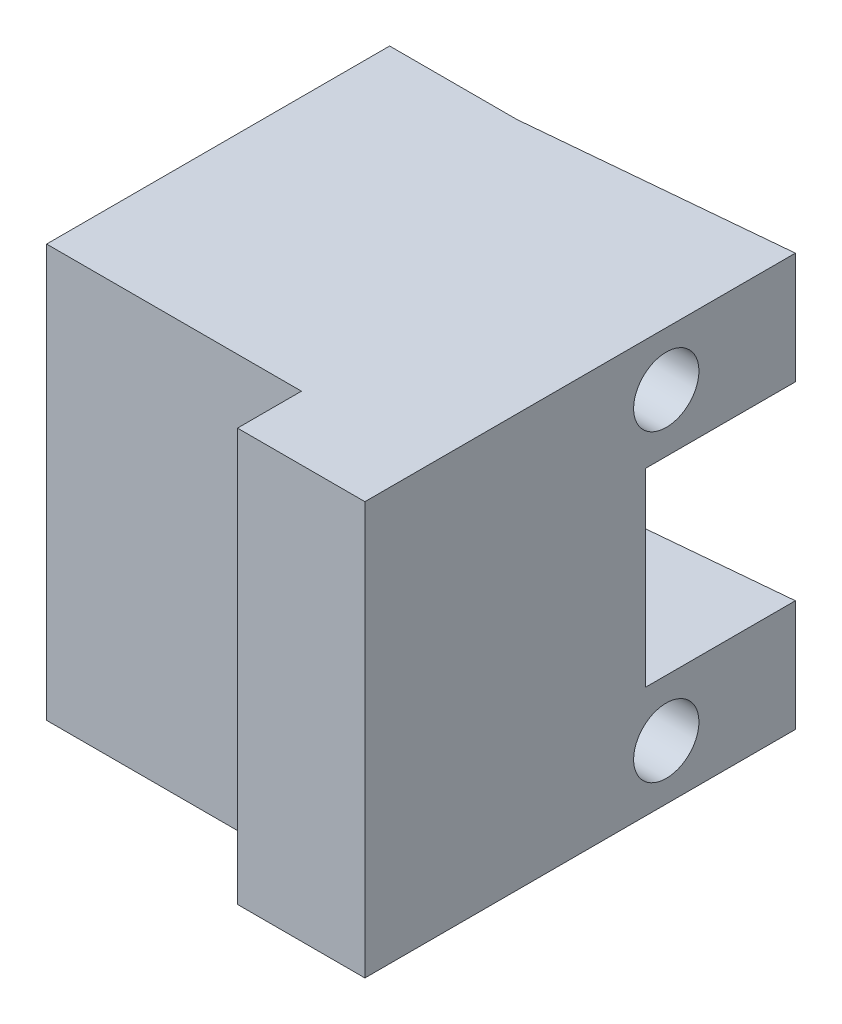
ISO-10303-21;
HEADER;
FILE_DESCRIPTION(('STEP AP214'),'2;1');
FILE_NAME('part.step','',(''),(''),'','','');
FILE_SCHEMA(('AUTOMOTIVE_DESIGN { 1 0 10303 214 1 1 1 1 }'));
ENDSEC;
DATA;
#1=APPLICATION_CONTEXT('core data for automotive mechanical design processes');
#2=APPLICATION_PROTOCOL_DEFINITION('international standard','automotive_design',2000,#1);
#3=PRODUCT_CONTEXT('',#1,'mechanical');
#4=PRODUCT('Part','Part','',(#3));
#5=PRODUCT_RELATED_PRODUCT_CATEGORY('part','',(#4));
#6=PRODUCT_DEFINITION_FORMATION('','',#4);
#7=PRODUCT_DEFINITION_CONTEXT('part definition',#1,'design');
#8=PRODUCT_DEFINITION('design','',#6,#7);
#9=PRODUCT_DEFINITION_SHAPE('','',#8);
#10=(LENGTH_UNIT() NAMED_UNIT(*) SI_UNIT(.MILLI.,.METRE.));
#11=(NAMED_UNIT(*) PLANE_ANGLE_UNIT() SI_UNIT($,.RADIAN.));
#12=(NAMED_UNIT(*) SI_UNIT($,.STERADIAN.) SOLID_ANGLE_UNIT());
#13=UNCERTAINTY_MEASURE_WITH_UNIT(LENGTH_MEASURE(1.E-05),#10,'distance_accuracy_value','');
#14=(GEOMETRIC_REPRESENTATION_CONTEXT(3) GLOBAL_UNCERTAINTY_ASSIGNED_CONTEXT((#13)) GLOBAL_UNIT_ASSIGNED_CONTEXT((#10,
#11,#12)) REPRESENTATION_CONTEXT('',''));
#15=CARTESIAN_POINT('',(0.,0.,0.));
#16=DIRECTION('',(0.,0.,1.));
#17=DIRECTION('',(1.,0.,0.));
#18=AXIS2_PLACEMENT_3D('',#15,#16,#17);
#19=CARTESIAN_POINT('',(116.999964556229,-120.556177447376,-106.221518242105));
#20=DIRECTION('',(-1.,0.,0.));
#21=DIRECTION('',(0.,1.,0.));
#22=AXIS2_PLACEMENT_3D('',#19,#20,#21);
#23=CYLINDRICAL_SURFACE('',#22,2.05);
#24=CARTESIAN_POINT('',(116.999964556229,-120.556177447376,-106.221518242105));
#25=DIRECTION('',(-1.,0.,0.));
#26=DIRECTION('',(0.,1.,0.));
#27=AXIS2_PLACEMENT_3D('',#24,#25,#26);
#28=CIRCLE('',#27,2.05);
#29=CARTESIAN_POINT('',(116.999964556229,-122.606177447376,-106.221518242105));
#30=VERTEX_POINT('',#29);
#31=EDGE_CURVE('E243',#30,#30,#28,.T.);
#32=ORIENTED_EDGE('',*,*,#31,.F.);
#33=DIRECTION('',(-1.,0.,0.));
#34=VECTOR('',#33,1.);
#35=CARTESIAN_POINT('',(116.999964556229,-122.606177447376,-106.221518242105));
#36=LINE('',#35,#34);
#37=CARTESIAN_POINT('',(105.999964556229,-122.606177447376,-106.221518242105));
#38=VERTEX_POINT('',#37);
#39=EDGE_CURVE('E11',#30,#38,#36,.T.);
#40=ORIENTED_EDGE('',*,*,#39,.T.);
#41=CARTESIAN_POINT('',(105.999964556229,-120.556177447376,-106.221518242105));
#42=DIRECTION('',(-1.,0.,0.));
#43=DIRECTION('',(0.,1.,0.));
#44=AXIS2_PLACEMENT_3D('',#41,#42,#43);
#45=CIRCLE('',#44,2.05);
#46=EDGE_CURVE('E238',#38,#38,#45,.T.);
#47=ORIENTED_EDGE('',*,*,#46,.T.);
#48=ORIENTED_EDGE('',*,*,#39,.F.);
#49=EDGE_LOOP('',(#32,#40,#47,#48));
#50=FACE_BOUND('',#49,.T.);
#51=ADVANCED_FACE('F16',(#50),#23,.F.);
#52=CARTESIAN_POINT('',(116.999964556229,-101.474691390343,-106.221518242105));
#53=DIRECTION('',(-1.,0.,0.));
#54=DIRECTION('',(0.,1.,0.));
#55=AXIS2_PLACEMENT_3D('',#52,#53,#54);
#56=CYLINDRICAL_SURFACE('',#55,2.05);
#57=CARTESIAN_POINT('',(116.999964556229,-101.474691390343,-106.221518242105));
#58=DIRECTION('',(-1.,0.,0.));
#59=DIRECTION('',(0.,1.,0.));
#60=AXIS2_PLACEMENT_3D('',#57,#58,#59);
#61=CIRCLE('',#60,2.05);
#62=CARTESIAN_POINT('',(116.999964556229,-103.524691390343,-106.221518242105));
#63=VERTEX_POINT('',#62);
#64=EDGE_CURVE('E247',#63,#63,#61,.T.);
#65=ORIENTED_EDGE('',*,*,#64,.F.);
#66=DIRECTION('',(-1.,0.,0.));
#67=VECTOR('',#66,1.);
#68=CARTESIAN_POINT('',(116.999964556229,-103.524691390343,-106.221518242105));
#69=LINE('',#68,#67);
#70=CARTESIAN_POINT('',(105.999964556229,-103.524691390343,-106.221518242105));
#71=VERTEX_POINT('',#70);
#72=EDGE_CURVE('E27',#63,#71,#69,.T.);
#73=ORIENTED_EDGE('',*,*,#72,.T.);
#74=CARTESIAN_POINT('',(105.999964556229,-101.474691390343,-106.221518242105));
#75=DIRECTION('',(-1.,0.,0.));
#76=DIRECTION('',(0.,1.,0.));
#77=AXIS2_PLACEMENT_3D('',#74,#75,#76);
#78=CIRCLE('',#77,2.05);
#79=EDGE_CURVE('E324',#71,#71,#78,.T.);
#80=ORIENTED_EDGE('',*,*,#79,.T.);
#81=ORIENTED_EDGE('',*,*,#72,.F.);
#82=EDGE_LOOP('',(#65,#73,#80,#81));
#83=FACE_BOUND('',#82,.T.);
#84=ADVANCED_FACE('F522',(#83),#56,.F.);
#85=CARTESIAN_POINT('',(108.99996276809,-111.050046491209,-125.958103894729));
#86=DIRECTION('',(-1.,0.,0.));
#87=DIRECTION('',(0.,1.,0.));
#88=AXIS2_PLACEMENT_3D('',#85,#86,#87);
#89=PLANE('',#88);
#90=DIRECTION('',(0.,-1.,0.));
#91=VECTOR('',#90,1.);
#92=CARTESIAN_POINT('',(108.99996276809,-117.525041958417,-91.3162066368525));
#93=LINE('',#92,#91);
#94=CARTESIAN_POINT('',(108.99996276809,-98.1000555567923,-91.3162066368525));
#95=VERTEX_POINT('',#94);
#96=CARTESIAN_POINT('',(108.99996276809,-124.000037425625,-91.3162066368525));
#97=VERTEX_POINT('',#96);
#98=EDGE_CURVE('E172',#95,#97,#93,.T.);
#99=ORIENTED_EDGE('',*,*,#98,.T.);
#100=DIRECTION('',(0.,0.,1.));
#101=VECTOR('',#100,1.);
#102=CARTESIAN_POINT('',(108.99996276809,-124.000037425625,-102.916206636852));
#103=LINE('',#102,#101);
#104=CARTESIAN_POINT('',(108.99996276809,-124.000037425625,-87.3002066368525));
#105=VERTEX_POINT('',#104);
#106=EDGE_CURVE('E160',#97,#105,#103,.T.);
#107=ORIENTED_EDGE('',*,*,#106,.T.);
#108=DIRECTION('',(0.,-1.,0.));
#109=VECTOR('',#108,1.);
#110=CARTESIAN_POINT('',(108.99996276809,-98.1000555567923,-87.3002066368525));
#111=LINE('',#110,#109);
#112=CARTESIAN_POINT('',(108.99996276809,-98.1000555567923,-87.3002066368525));
#113=VERTEX_POINT('',#112);
#114=EDGE_CURVE('E175',#113,#105,#111,.T.);
#115=ORIENTED_EDGE('',*,*,#114,.F.);
#116=DIRECTION('',(0.,0.,1.));
#117=VECTOR('',#116,1.);
#118=CARTESIAN_POINT('',(108.99996276809,-98.1000555567923,-102.916206636852));
#119=LINE('',#118,#117);
#120=EDGE_CURVE('E168',#95,#113,#119,.T.);
#121=ORIENTED_EDGE('',*,*,#120,.F.);
#122=EDGE_LOOP('',(#99,#107,#115,#121));
#123=FACE_BOUND('',#122,.T.);
#124=ADVANCED_FACE('F170',(#123),#89,.T.);
#125=CARTESIAN_POINT('',(116.999964556229,-98.1000555567923,-114.32786540527));
#126=DIRECTION('',(0.0918174933381671,0.,0.995775852246426));
#127=DIRECTION('',(0.,-1.,0.));
#128=AXIS2_PLACEMENT_3D('',#125,#126,#127);
#129=PLANE('',#128);
#130=DIRECTION('',(0.,1.,0.));
#131=VECTOR('',#130,1.);
#132=CARTESIAN_POINT('',(100.99996276809,-98.1000555567923,-112.852553411834));
#133=LINE('',#132,#131);
#134=CARTESIAN_POINT('',(100.99996276809,-105.100055556792,-112.852553411834));
#135=VERTEX_POINT('',#134);
#136=CARTESIAN_POINT('',(100.99996276809,-98.1000555567923,-112.852553411834));
#137=VERTEX_POINT('',#136);
#138=EDGE_CURVE('E286',#135,#137,#133,.T.);
#139=ORIENTED_EDGE('',*,*,#138,.T.);
#140=DIRECTION('',(-0.995775852246426,0.,0.0918174933381671));
#141=VECTOR('',#140,1.);
#142=CARTESIAN_POINT('',(126.393977207077,-98.1000555567923,-115.194059029108));
#143=LINE('',#142,#141);
#144=CARTESIAN_POINT('',(116.999964556229,-98.1000555567923,-114.32786540527));
#145=VERTEX_POINT('',#144);
#146=EDGE_CURVE('E222',#145,#137,#143,.T.);
#147=ORIENTED_EDGE('',*,*,#146,.F.);
#148=DIRECTION('',(0.,-1.,0.));
#149=VECTOR('',#148,1.);
#150=CARTESIAN_POINT('',(116.999964556229,-104.100037142503,-114.32786540527));
#151=LINE('',#150,#149);
#152=CARTESIAN_POINT('',(116.999964556229,-105.100055556792,-114.32786540527));
#153=VERTEX_POINT('',#152);
#154=EDGE_CURVE('E252',#145,#153,#151,.T.);
#155=ORIENTED_EDGE('',*,*,#154,.T.);
#156=DIRECTION('',(0.995775852246426,0.,-0.091817493338167));
#157=VECTOR('',#156,1.);
#158=CARTESIAN_POINT('',(100.99996276809,-105.100055556792,-112.852553411834));
#159=LINE('',#158,#157);
#160=EDGE_CURVE('E20',#135,#153,#159,.T.);
#161=ORIENTED_EDGE('',*,*,#160,.F.);
#162=EDGE_LOOP('',(#139,#147,#155,#161));
#163=FACE_BOUND('',#162,.T.);
#164=ADVANCED_FACE('F387',(#163),#129,.F.);
#165=CARTESIAN_POINT('',(116.999964556229,-98.1000555567923,-114.32786540527));
#166=DIRECTION('',(0.0918174933381671,0.,0.995775852246426));
#167=DIRECTION('',(0.,-1.,0.));
#168=AXIS2_PLACEMENT_3D('',#165,#166,#167);
#169=PLANE('',#168);
#170=DIRECTION('',(0.,1.,0.));
#171=VECTOR('',#170,1.);
#172=CARTESIAN_POINT('',(100.99996276809,-107.550055556792,-112.852553411834));
#173=LINE('',#172,#171);
#174=CARTESIAN_POINT('',(100.99996276809,-124.000037425625,-112.852553411834));
#175=VERTEX_POINT('',#174);
#176=CARTESIAN_POINT('',(100.99996276809,-117.000055556792,-112.852553411834));
#177=VERTEX_POINT('',#176);
#178=EDGE_CURVE('E226',#175,#177,#173,.T.);
#179=ORIENTED_EDGE('',*,*,#178,.T.);
#180=DIRECTION('',(-0.995775852246426,0.,0.0918174933381671));
#181=VECTOR('',#180,1.);
#182=CARTESIAN_POINT('',(116.543314738839,-117.000055556792,-114.285759100451));
#183=LINE('',#182,#181);
#184=CARTESIAN_POINT('',(116.999964556229,-117.000055556792,-114.32786540527));
#185=VERTEX_POINT('',#184);
#186=EDGE_CURVE('E181',#185,#177,#183,.T.);
#187=ORIENTED_EDGE('',*,*,#186,.F.);
#188=DIRECTION('',(0.,1.,0.));
#189=VECTOR('',#188,1.);
#190=CARTESIAN_POINT('',(116.999964556229,-118.000055556792,-114.32786540527));
#191=LINE('',#190,#189);
#192=CARTESIAN_POINT('',(116.999964556229,-124.000037425625,-114.32786540527));
#193=VERTEX_POINT('',#192);
#194=EDGE_CURVE('E248',#193,#185,#191,.T.);
#195=ORIENTED_EDGE('',*,*,#194,.F.);
#196=DIRECTION('',(0.995775852246426,0.,-0.0918174933381671));
#197=VECTOR('',#196,1.);
#198=CARTESIAN_POINT('',(128.500689640032,-124.000037425625,-115.38831263984));
#199=LINE('',#198,#197);
#200=EDGE_CURVE('E217',#175,#193,#199,.T.);
#201=ORIENTED_EDGE('',*,*,#200,.F.);
#202=EDGE_LOOP('',(#179,#187,#195,#201));
#203=FACE_BOUND('',#202,.T.);
#204=ADVANCED_FACE('F378',(#203),#169,.F.);
#205=CARTESIAN_POINT('',(105.999964556229,-120.556177447376,-106.221518242105));
#206=DIRECTION('',(1.,0.,0.));
#207=DIRECTION('',(0.,-1.,0.));
#208=AXIS2_PLACEMENT_3D('',#205,#206,#207);
#209=PLANE('',#208);
#210=ORIENTED_EDGE('',*,*,#46,.F.);
#211=EDGE_LOOP('',(#210));
#212=FACE_BOUND('',#211,.T.);
#213=ADVANCED_FACE('F462',(#212),#209,.T.);
#214=CARTESIAN_POINT('',(105.999964556229,-101.474691390343,-106.221518242105));
#215=DIRECTION('',(1.,0.,0.));
#216=DIRECTION('',(0.,-1.,0.));
#217=AXIS2_PLACEMENT_3D('',#214,#215,#216);
#218=PLANE('',#217);
#219=ORIENTED_EDGE('',*,*,#79,.F.);
#220=EDGE_LOOP('',(#219));
#221=FACE_BOUND('',#220,.T.);
#222=ADVANCED_FACE('F494',(#221),#218,.T.);
#223=CARTESIAN_POINT('',(116.999964556229,-117.000037306416,-86.));
#224=DIRECTION('',(-1.,0.,0.));
#225=DIRECTION('',(0.,0.,1.));
#226=AXIS2_PLACEMENT_3D('',#223,#224,#225);
#227=PLANE('',#226);
#228=ORIENTED_EDGE('',*,*,#64,.T.);
#229=EDGE_LOOP('',(#228));
#230=FACE_BOUND('',#229,.T.);
#231=ORIENTED_EDGE('',*,*,#31,.T.);
#232=EDGE_LOOP('',(#231));
#233=FACE_BOUND('',#232,.T.);
#234=DIRECTION('',(0.,1.,0.));
#235=VECTOR('',#234,1.);
#236=CARTESIAN_POINT('',(116.999964556229,-107.550046431604,-104.916206636853));
#237=LINE('',#236,#235);
#238=CARTESIAN_POINT('',(116.999964556229,-117.000037306416,-104.916206636853));
#239=VERTEX_POINT('',#238);
#240=CARTESIAN_POINT('',(116.999964556229,-105.100037142503,-104.916206636853));
#241=VERTEX_POINT('',#240);
#242=EDGE_CURVE('E249',#239,#241,#237,.T.);
#243=ORIENTED_EDGE('',*,*,#242,.T.);
#244=DIRECTION('',(0.,0.,1.));
#245=VECTOR('',#244,1.);
#246=CARTESIAN_POINT('',(116.999964556229,-105.100055556792,-98.4581033184263));
#247=LINE('',#246,#245);
#248=CARTESIAN_POINT('',(116.999964556229,-105.100055556792,-110.916206636853));
#249=VERTEX_POINT('',#248);
#250=EDGE_CURVE('E259',#249,#241,#247,.T.);
#251=ORIENTED_EDGE('',*,*,#250,.F.);
#252=DIRECTION('',(0.,0.,-1.));
#253=VECTOR('',#252,1.);
#254=CARTESIAN_POINT('',(116.999964556229,-105.100055556792,-110.916206636853));
#255=LINE('',#254,#253);
#256=EDGE_CURVE('E265',#153,#249,#255,.F.);
#257=ORIENTED_EDGE('',*,*,#256,.F.);
#258=ORIENTED_EDGE('',*,*,#154,.F.);
#259=DIRECTION('',(0.,0.,1.));
#260=VECTOR('',#259,1.);
#261=CARTESIAN_POINT('',(116.999964556229,-98.1000555567923,-114.437155265791));
#262=LINE('',#261,#260);
#263=CARTESIAN_POINT('',(116.999964556229,-98.1000555567923,-87.3002066368526));
#264=VERTEX_POINT('',#263);
#265=EDGE_CURVE('E180',#145,#264,#262,.T.);
#266=ORIENTED_EDGE('',*,*,#265,.T.);
#267=DIRECTION('',(0.,1.,0.));
#268=VECTOR('',#267,1.);
#269=CARTESIAN_POINT('',(116.999964556229,-117.525048920428,-87.3002066368525));
#270=LINE('',#269,#268);
#271=CARTESIAN_POINT('',(116.999964556229,-124.000037425625,-87.3002066368526));
#272=VERTEX_POINT('',#271);
#273=EDGE_CURVE('E192',#272,#264,#270,.T.);
#274=ORIENTED_EDGE('',*,*,#273,.F.);
#275=DIRECTION('',(0.,0.,-1.));
#276=VECTOR('',#275,1.);
#277=CARTESIAN_POINT('',(116.999964556229,-124.000037425625,-137.479052523667));
#278=LINE('',#277,#276);
#279=EDGE_CURVE('E221',#272,#193,#278,.T.);
#280=ORIENTED_EDGE('',*,*,#279,.T.);
#281=ORIENTED_EDGE('',*,*,#194,.T.);
#282=DIRECTION('',(0.,0.,-1.));
#283=VECTOR('',#282,1.);
#284=CARTESIAN_POINT('',(116.999964556229,-117.000055556792,-100.591975971241));
#285=LINE('',#284,#283);
#286=CARTESIAN_POINT('',(116.999964556229,-117.000037306416,-110.916206636853));
#287=VERTEX_POINT('',#286);
#288=EDGE_CURVE('E272',#287,#185,#285,.T.);
#289=ORIENTED_EDGE('',*,*,#288,.F.);
#290=DIRECTION('',(0.,0.,-1.));
#291=VECTOR('',#290,1.);
#292=CARTESIAN_POINT('',(116.999964556229,-117.000055556792,-100.591975971241));
#293=LINE('',#292,#291);
#294=EDGE_CURVE('E268',#239,#287,#293,.T.);
#295=ORIENTED_EDGE('',*,*,#294,.F.);
#296=EDGE_LOOP('',(#243,#251,#257,#258,#266,#274,#280,#281,#289,#295));
#297=FACE_BOUND('',#296,.T.);
#298=ADVANCED_FACE('F381',(#230,#233,#297),#227,.F.);
#299=CARTESIAN_POINT('',(131.99996276809,-98.1000555567923,-104.916206636853));
#300=DIRECTION('',(0.,0.,1.));
#301=DIRECTION('',(1.,0.,0.));
#302=AXIS2_PLACEMENT_3D('',#299,#300,#301);
#303=PLANE('',#302);
#304=DIRECTION('',(1.,0.,0.));
#305=VECTOR('',#304,1.);
#306=CARTESIAN_POINT('',(124.499963662159,-105.100055556792,-104.916206636853));
#307=LINE('',#306,#305);
#308=CARTESIAN_POINT('',(92.99996276809,-105.100055556792,-104.916206636852));
#309=VERTEX_POINT('',#308);
#310=EDGE_CURVE('E253',#309,#241,#307,.T.);
#311=ORIENTED_EDGE('',*,*,#310,.T.);
#312=ORIENTED_EDGE('',*,*,#242,.F.);
#313=DIRECTION('',(-1.,0.,0.));
#314=VECTOR('',#313,1.);
#315=CARTESIAN_POINT('',(100.99996276809,-117.000055556792,-104.916206636852));
#316=LINE('',#315,#314);
#317=CARTESIAN_POINT('',(92.99996276809,-117.000055556792,-104.916206636852));
#318=VERTEX_POINT('',#317);
#319=EDGE_CURVE('E211',#239,#318,#316,.T.);
#320=ORIENTED_EDGE('',*,*,#319,.T.);
#321=DIRECTION('',(0.,-1.,0.));
#322=VECTOR('',#321,1.);
#323=CARTESIAN_POINT('',(92.99996276809,-104.575051024,-104.916206636853));
#324=LINE('',#323,#322);
#325=EDGE_CURVE('E239',#309,#318,#324,.T.);
#326=ORIENTED_EDGE('',*,*,#325,.F.);
#327=EDGE_LOOP('',(#311,#312,#320,#326));
#328=FACE_BOUND('',#327,.T.);
#329=ADVANCED_FACE('F364',(#328),#303,.F.);
#330=CARTESIAN_POINT('',(116.999964556229,-105.100055556792,-110.916206636853));
#331=DIRECTION('',(0.,-1.,0.));
#332=DIRECTION('',(-1.,0.,0.));
#333=AXIS2_PLACEMENT_3D('',#330,#331,#332);
#334=PLANE('',#333);
#335=ORIENTED_EDGE('',*,*,#160,.T.);
#336=ORIENTED_EDGE('',*,*,#256,.T.);
#337=ORIENTED_EDGE('',*,*,#250,.T.);
#338=ORIENTED_EDGE('',*,*,#310,.F.);
#339=DIRECTION('',(0.,0.,1.));
#340=VECTOR('',#339,1.);
#341=CARTESIAN_POINT('',(92.99996276809,-105.100055556792,-110.916206636852));
#342=LINE('',#341,#340);
#343=CARTESIAN_POINT('',(92.99996276809,-105.100055556792,-112.852553411834));
#344=VERTEX_POINT('',#343);
#345=EDGE_CURVE('E241',#344,#309,#342,.T.);
#346=ORIENTED_EDGE('',*,*,#345,.F.);
#347=DIRECTION('',(-1.,0.,0.));
#348=VECTOR('',#347,1.);
#349=CARTESIAN_POINT('',(100.99996276809,-105.100055556792,-112.852553411834));
#350=LINE('',#349,#348);
#351=EDGE_CURVE('E281',#135,#344,#350,.T.);
#352=ORIENTED_EDGE('',*,*,#351,.F.);
#353=EDGE_LOOP('',(#335,#336,#337,#338,#346,#352));
#354=FACE_BOUND('',#353,.T.);
#355=ADVANCED_FACE('F358',(#354),#334,.T.);
#356=CARTESIAN_POINT('',(136.99996276809,-124.000037425625,-149.000001152606));
#357=DIRECTION('',(0.,-1.,0.));
#358=DIRECTION('',(-1.,0.,0.));
#359=AXIS2_PLACEMENT_3D('',#356,#357,#358);
#360=PLANE('',#359);
#361=ORIENTED_EDGE('',*,*,#200,.T.);
#362=ORIENTED_EDGE('',*,*,#279,.F.);
#363=DIRECTION('',(1.,0.,0.));
#364=VECTOR('',#363,1.);
#365=CARTESIAN_POINT('',(136.99996276809,-124.000037425625,-87.3002066368526));
#366=LINE('',#365,#364);
#367=EDGE_CURVE('E207',#105,#272,#366,.T.);
#368=ORIENTED_EDGE('',*,*,#367,.F.);
#369=ORIENTED_EDGE('',*,*,#106,.F.);
#370=DIRECTION('',(-1.,0.,0.));
#371=VECTOR('',#370,1.);
#372=CARTESIAN_POINT('',(100.99996276809,-124.000037425625,-91.3162066368525));
#373=LINE('',#372,#371);
#374=CARTESIAN_POINT('',(92.99996276809,-124.000037425625,-91.3162066368525));
#375=VERTEX_POINT('',#374);
#376=EDGE_CURVE('E195',#97,#375,#373,.T.);
#377=ORIENTED_EDGE('',*,*,#376,.T.);
#378=DIRECTION('',(0.,0.,1.));
#379=VECTOR('',#378,1.);
#380=CARTESIAN_POINT('',(92.99996276809,-124.000037425625,-129.958103894729));
#381=LINE('',#380,#379);
#382=CARTESIAN_POINT('',(92.99996276809,-124.000037425625,-112.852553411834));
#383=VERTEX_POINT('',#382);
#384=EDGE_CURVE('E316',#383,#375,#381,.T.);
#385=ORIENTED_EDGE('',*,*,#384,.F.);
#386=DIRECTION('',(-1.,0.,0.));
#387=VECTOR('',#386,1.);
#388=CARTESIAN_POINT('',(100.99996276809,-124.000037425625,-112.852553411834));
#389=LINE('',#388,#387);
#390=EDGE_CURVE('E215',#175,#383,#389,.T.);
#391=ORIENTED_EDGE('',*,*,#390,.F.);
#392=EDGE_LOOP('',(#361,#362,#368,#369,#377,#385,#391));
#393=FACE_BOUND('',#392,.T.);
#394=ADVANCED_FACE('F376',(#393),#360,.T.);
#395=CARTESIAN_POINT('',(136.99996276809,-98.1000555567923,-102.916206636853));
#396=DIRECTION('',(0.,1.,0.));
#397=DIRECTION('',(1.,0.,0.));
#398=AXIS2_PLACEMENT_3D('',#395,#396,#397);
#399=PLANE('',#398);
#400=DIRECTION('',(-1.,0.,0.));
#401=VECTOR('',#400,1.);
#402=CARTESIAN_POINT('',(131.99996276809,-98.1000555567923,-91.3162066368525));
#403=LINE('',#402,#401);
#404=CARTESIAN_POINT('',(92.99996276809,-98.1000555567923,-91.3162066368525));
#405=VERTEX_POINT('',#404);
#406=EDGE_CURVE('E184',#95,#405,#403,.T.);
#407=ORIENTED_EDGE('',*,*,#406,.F.);
#408=ORIENTED_EDGE('',*,*,#120,.T.);
#409=DIRECTION('',(-1.,0.,0.));
#410=VECTOR('',#409,1.);
#411=CARTESIAN_POINT('',(136.99996276809,-98.1000555567923,-87.3002066368526));
#412=LINE('',#411,#410);
#413=EDGE_CURVE('E233',#264,#113,#412,.T.);
#414=ORIENTED_EDGE('',*,*,#413,.F.);
#415=ORIENTED_EDGE('',*,*,#265,.F.);
#416=ORIENTED_EDGE('',*,*,#146,.T.);
#417=DIRECTION('',(-1.,0.,0.));
#418=VECTOR('',#417,1.);
#419=CARTESIAN_POINT('',(100.99996276809,-98.1000555567923,-112.852553411834));
#420=LINE('',#419,#418);
#421=CARTESIAN_POINT('',(92.99996276809,-98.1000555567923,-112.852553411834));
#422=VERTEX_POINT('',#421);
#423=EDGE_CURVE('E205',#137,#422,#420,.T.);
#424=ORIENTED_EDGE('',*,*,#423,.T.);
#425=DIRECTION('',(0.,0.,-1.));
#426=VECTOR('',#425,1.);
#427=CARTESIAN_POINT('',(92.99996276809,-98.1000555567923,-106.916206636852));
#428=LINE('',#427,#426);
#429=EDGE_CURVE('E187',#405,#422,#428,.T.);
#430=ORIENTED_EDGE('',*,*,#429,.F.);
#431=EDGE_LOOP('',(#407,#408,#414,#415,#416,#424,#430));
#432=FACE_BOUND('',#431,.T.);
#433=ADVANCED_FACE('F185',(#432),#399,.T.);
#434=CARTESIAN_POINT('',(115.99996276809,-117.000055556792,-115.183951942483));
#435=DIRECTION('',(0.,1.,0.));
#436=DIRECTION('',(1.,0.,0.));
#437=AXIS2_PLACEMENT_3D('',#434,#435,#436);
#438=PLANE('',#437);
#439=ORIENTED_EDGE('',*,*,#319,.F.);
#440=ORIENTED_EDGE('',*,*,#294,.T.);
#441=ORIENTED_EDGE('',*,*,#288,.T.);
#442=ORIENTED_EDGE('',*,*,#186,.T.);
#443=DIRECTION('',(-1.,0.,0.));
#444=VECTOR('',#443,1.);
#445=CARTESIAN_POINT('',(100.99996276809,-117.000055556792,-112.852553411834));
#446=LINE('',#445,#444);
#447=CARTESIAN_POINT('',(92.99996276809,-117.000055556792,-112.852553411834));
#448=VERTEX_POINT('',#447);
#449=EDGE_CURVE('E214',#177,#448,#446,.T.);
#450=ORIENTED_EDGE('',*,*,#449,.T.);
#451=DIRECTION('',(0.,0.,-1.));
#452=VECTOR('',#451,1.);
#453=CARTESIAN_POINT('',(92.99996276809,-117.000055556792,-113.050079289668));
#454=LINE('',#453,#452);
#455=EDGE_CURVE('E139',#318,#448,#454,.T.);
#456=ORIENTED_EDGE('',*,*,#455,.F.);
#457=EDGE_LOOP('',(#439,#440,#441,#442,#450,#456));
#458=FACE_BOUND('',#457,.T.);
#459=ADVANCED_FACE('F368',(#458),#438,.T.);
#460=CARTESIAN_POINT('',(136.99996276809,-124.000037425625,-87.3002066368526));
#461=DIRECTION('',(0.,0.,1.));
#462=DIRECTION('',(1.,0.,0.));
#463=AXIS2_PLACEMENT_3D('',#460,#461,#462);
#464=PLANE('',#463);
#465=ORIENTED_EDGE('',*,*,#273,.T.);
#466=ORIENTED_EDGE('',*,*,#413,.T.);
#467=ORIENTED_EDGE('',*,*,#114,.T.);
#468=ORIENTED_EDGE('',*,*,#367,.T.);
#469=EDGE_LOOP('',(#465,#466,#467,#468));
#470=FACE_BOUND('',#469,.T.);
#471=ADVANCED_FACE('F383',(#470),#464,.T.);
#472=CARTESIAN_POINT('',(131.99996276809,-124.000037425625,-91.3162066368525));
#473=DIRECTION('',(0.,0.,1.));
#474=DIRECTION('',(1.,0.,0.));
#475=AXIS2_PLACEMENT_3D('',#472,#473,#474);
#476=PLANE('',#475);
#477=ORIENTED_EDGE('',*,*,#376,.F.);
#478=ORIENTED_EDGE('',*,*,#98,.F.);
#479=ORIENTED_EDGE('',*,*,#406,.T.);
#480=DIRECTION('',(0.,1.,0.));
#481=VECTOR('',#480,1.);
#482=CARTESIAN_POINT('',(92.99996276809,-117.525041958417,-91.3162066368525));
#483=LINE('',#482,#481);
#484=EDGE_CURVE('E313',#375,#405,#483,.T.);
#485=ORIENTED_EDGE('',*,*,#484,.F.);
#486=EDGE_LOOP('',(#477,#478,#479,#485));
#487=FACE_BOUND('',#486,.T.);
#488=ADVANCED_FACE('F194',(#487),#476,.T.);
#489=CARTESIAN_POINT('',(92.99996276809,-111.050046491209,-108.416206636852));
#490=DIRECTION('',(-1.,0.,0.));
#491=DIRECTION('',(0.,0.,1.));
#492=AXIS2_PLACEMENT_3D('',#489,#490,#491);
#493=PLANE('',#492);
#494=ORIENTED_EDGE('',*,*,#384,.T.);
#495=ORIENTED_EDGE('',*,*,#484,.T.);
#496=ORIENTED_EDGE('',*,*,#429,.T.);
#497=DIRECTION('',(0.,-1.,0.));
#498=VECTOR('',#497,1.);
#499=CARTESIAN_POINT('',(92.99996276809,-98.1000555567923,-112.852553411834));
#500=LINE('',#499,#498);
#501=EDGE_CURVE('E285',#422,#344,#500,.T.);
#502=ORIENTED_EDGE('',*,*,#501,.T.);
#503=ORIENTED_EDGE('',*,*,#345,.T.);
#504=ORIENTED_EDGE('',*,*,#325,.T.);
#505=ORIENTED_EDGE('',*,*,#455,.T.);
#506=DIRECTION('',(0.,-1.,0.));
#507=VECTOR('',#506,1.);
#508=CARTESIAN_POINT('',(92.99996276809,-107.550055556792,-112.852553411834));
#509=LINE('',#508,#507);
#510=EDGE_CURVE('E212',#448,#383,#509,.T.);
#511=ORIENTED_EDGE('',*,*,#510,.T.);
#512=EDGE_LOOP('',(#494,#495,#496,#502,#503,#504,#505,#511));
#513=FACE_BOUND('',#512,.T.);
#514=ADVANCED_FACE('F18',(#513),#493,.T.);
#515=CARTESIAN_POINT('',(100.99996276809,-98.1000555567923,-112.852553411834));
#516=DIRECTION('',(0.,0.,-1.));
#517=DIRECTION('',(0.,-1.,0.));
#518=AXIS2_PLACEMENT_3D('',#515,#516,#517);
#519=PLANE('',#518);
#520=ORIENTED_EDGE('',*,*,#138,.F.);
#521=ORIENTED_EDGE('',*,*,#351,.T.);
#522=ORIENTED_EDGE('',*,*,#501,.F.);
#523=ORIENTED_EDGE('',*,*,#423,.F.);
#524=EDGE_LOOP('',(#520,#521,#522,#523));
#525=FACE_BOUND('',#524,.T.);
#526=ADVANCED_FACE('F501',(#525),#519,.T.);
#527=CARTESIAN_POINT('',(100.99996276809,-117.000055556792,-112.852553411834));
#528=DIRECTION('',(0.,0.,-1.));
#529=DIRECTION('',(0.,-1.,0.));
#530=AXIS2_PLACEMENT_3D('',#527,#528,#529);
#531=PLANE('',#530);
#532=ORIENTED_EDGE('',*,*,#178,.F.);
#533=ORIENTED_EDGE('',*,*,#390,.T.);
#534=ORIENTED_EDGE('',*,*,#510,.F.);
#535=ORIENTED_EDGE('',*,*,#449,.F.);
#536=EDGE_LOOP('',(#532,#533,#534,#535));
#537=FACE_BOUND('',#536,.T.);
#538=ADVANCED_FACE('F374',(#537),#531,.T.);
#539=CLOSED_SHELL('',(#51,#84,#124,#164,#204,#213,#222,#298,#329,#355,#394,#433,#459,#471,#488,
#514,#526,#538));
#540=MANIFOLD_SOLID_BREP('B1',#539);
#541=ADVANCED_BREP_SHAPE_REPRESENTATION('',(#18,#540),#14);
#542=SHAPE_DEFINITION_REPRESENTATION(#9,#541);
ENDSEC;
END-ISO-10303-21;
